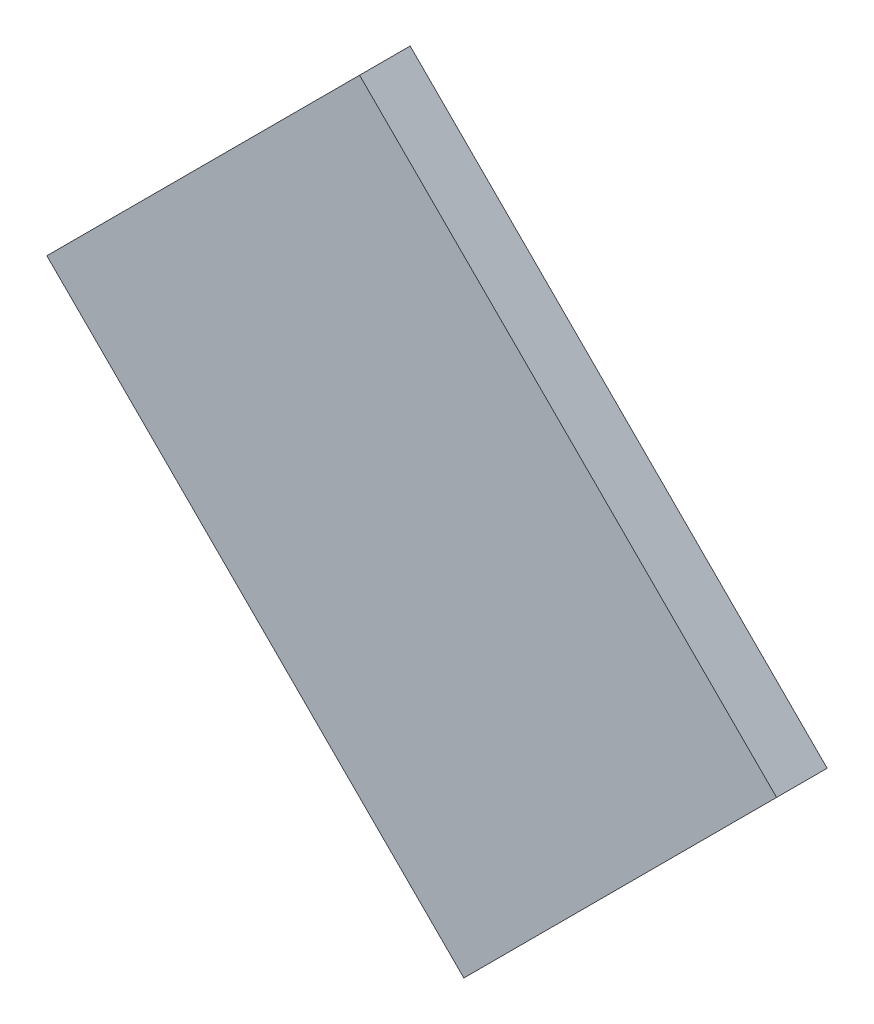
ISO-10303-21;
HEADER;
FILE_DESCRIPTION(('STEP AP214'),'2;1');
FILE_NAME('part.step','',(''),(''),'','','');
FILE_SCHEMA(('AUTOMOTIVE_DESIGN { 1 0 10303 214 1 1 1 1 }'));
ENDSEC;
DATA;
#1=APPLICATION_CONTEXT('core data for automotive mechanical design processes');
#2=APPLICATION_PROTOCOL_DEFINITION('international standard','automotive_design',2000,#1);
#3=PRODUCT_CONTEXT('',#1,'mechanical');
#4=PRODUCT('Part','Part','',(#3));
#5=PRODUCT_RELATED_PRODUCT_CATEGORY('part','',(#4));
#6=PRODUCT_DEFINITION_FORMATION('','',#4);
#7=PRODUCT_DEFINITION_CONTEXT('part definition',#1,'design');
#8=PRODUCT_DEFINITION('design','',#6,#7);
#9=PRODUCT_DEFINITION_SHAPE('','',#8);
#10=(LENGTH_UNIT() NAMED_UNIT(*) SI_UNIT(.MILLI.,.METRE.));
#11=(NAMED_UNIT(*) PLANE_ANGLE_UNIT() SI_UNIT($,.RADIAN.));
#12=(NAMED_UNIT(*) SI_UNIT($,.STERADIAN.) SOLID_ANGLE_UNIT());
#13=UNCERTAINTY_MEASURE_WITH_UNIT(LENGTH_MEASURE(1.E-05),#10,'distance_accuracy_value','');
#14=(GEOMETRIC_REPRESENTATION_CONTEXT(3) GLOBAL_UNCERTAINTY_ASSIGNED_CONTEXT((#13)) GLOBAL_UNIT_ASSIGNED_CONTEXT((#10,
#11,#12)) REPRESENTATION_CONTEXT('',''));
#15=CARTESIAN_POINT('',(0.,0.,0.));
#16=DIRECTION('',(0.,0.,1.));
#17=DIRECTION('',(1.,0.,0.));
#18=AXIS2_PLACEMENT_3D('',#15,#16,#17);
#19=CARTESIAN_POINT('',(4.5680453335,8.7844453335,0.76487));
#20=DIRECTION('',(0.,0.,-1.));
#21=DIRECTION('',(0.,1.,0.));
#22=AXIS2_PLACEMENT_3D('',#19,#20,#21);
#23=PLANE('',#22);
#24=DIRECTION('',(0.707106781186548,0.707106781186548,0.));
#25=VECTOR('',#24,1.);
#26=CARTESIAN_POINT('',(4.320558,8.819800667,0.76487));
#27=LINE('',#26,#25);
#28=CARTESIAN_POINT('',(4.320558,8.819800667,0.76487));
#29=VERTEX_POINT('',#28);
#30=CARTESIAN_POINT('',(4.53269,9.031932667,0.76487));
#31=VERTEX_POINT('',#30);
#32=EDGE_CURVE('E55',#29,#31,#27,.T.);
#33=ORIENTED_EDGE('',*,*,#32,.T.);
#34=DIRECTION('',(0.707106781186548,-0.707106781186548,0.));
#35=VECTOR('',#34,1.);
#36=CARTESIAN_POINT('',(4.53269,9.031932667,0.76487));
#37=LINE('',#36,#35);
#38=CARTESIAN_POINT('',(4.815532667,8.74909,0.76487));
#39=VERTEX_POINT('',#38);
#40=EDGE_CURVE('E57',#31,#39,#37,.T.);
#41=ORIENTED_EDGE('',*,*,#40,.T.);
#42=DIRECTION('',(-0.707106781186548,-0.707106781186548,0.));
#43=VECTOR('',#42,1.);
#44=CARTESIAN_POINT('',(4.815532667,8.74909,0.76487));
#45=LINE('',#44,#43);
#46=CARTESIAN_POINT('',(4.603400667,8.536958,0.76487));
#47=VERTEX_POINT('',#46);
#48=EDGE_CURVE('E20',#39,#47,#45,.T.);
#49=ORIENTED_EDGE('',*,*,#48,.T.);
#50=DIRECTION('',(-0.707106781186548,0.707106781186548,0.));
#51=VECTOR('',#50,1.);
#52=CARTESIAN_POINT('',(4.603400667,8.536958,0.76487));
#53=LINE('',#52,#51);
#54=EDGE_CURVE('E80',#47,#29,#53,.T.);
#55=ORIENTED_EDGE('',*,*,#54,.T.);
#56=EDGE_LOOP('',(#33,#41,#49,#55));
#57=FACE_BOUND('',#56,.T.);
#58=ADVANCED_FACE('F17',(#57),#23,.T.);
#59=CARTESIAN_POINT('',(4.815532667,8.74909,0.76487));
#60=DIRECTION('',(-0.707106781186548,0.707106781186548,0.));
#61=DIRECTION('',(-0.707106781186548,-0.707106781186548,0.));
#62=AXIS2_PLACEMENT_3D('',#59,#60,#61);
#63=PLANE('',#62);
#64=DIRECTION('',(0.,0.,1.));
#65=VECTOR('',#64,1.);
#66=CARTESIAN_POINT('',(4.603400667,8.536958,0.76487));
#67=LINE('',#66,#65);
#68=CARTESIAN_POINT('',(4.603400667,8.536958,0.79916));
#69=VERTEX_POINT('',#68);
#70=EDGE_CURVE('E68',#69,#47,#67,.F.);
#71=ORIENTED_EDGE('',*,*,#70,.T.);
#72=ORIENTED_EDGE('',*,*,#48,.F.);
#73=DIRECTION('',(0.,0.,1.));
#74=VECTOR('',#73,1.);
#75=CARTESIAN_POINT('',(4.815532667,8.74909,0.76487));
#76=LINE('',#75,#74);
#77=CARTESIAN_POINT('',(4.815532667,8.74909,0.79916));
#78=VERTEX_POINT('',#77);
#79=EDGE_CURVE('E63',#39,#78,#76,.T.);
#80=ORIENTED_EDGE('',*,*,#79,.T.);
#81=DIRECTION('',(0.707106781186548,0.707106781186548,0.));
#82=VECTOR('',#81,1.);
#83=CARTESIAN_POINT('',(4.603400667,8.536958,0.79916));
#84=LINE('',#83,#82);
#85=EDGE_CURVE('E83',#69,#78,#84,.T.);
#86=ORIENTED_EDGE('',*,*,#85,.F.);
#87=EDGE_LOOP('',(#71,#72,#80,#86));
#88=FACE_BOUND('',#87,.T.);
#89=ADVANCED_FACE('F65',(#88),#63,.F.);
#90=CARTESIAN_POINT('',(4.53269,9.031932667,0.76487));
#91=DIRECTION('',(-0.707106781186548,-0.707106781186548,0.));
#92=DIRECTION('',(0.707106781186548,-0.707106781186548,0.));
#93=AXIS2_PLACEMENT_3D('',#90,#91,#92);
#94=PLANE('',#93);
#95=ORIENTED_EDGE('',*,*,#79,.F.);
#96=ORIENTED_EDGE('',*,*,#40,.F.);
#97=DIRECTION('',(0.,0.,1.));
#98=VECTOR('',#97,1.);
#99=CARTESIAN_POINT('',(4.53269,9.031932667,0.76487));
#100=LINE('',#99,#98);
#101=CARTESIAN_POINT('',(4.53269,9.031932667,0.79916));
#102=VERTEX_POINT('',#101);
#103=EDGE_CURVE('E75',#31,#102,#100,.T.);
#104=ORIENTED_EDGE('',*,*,#103,.T.);
#105=DIRECTION('',(-0.70710678118655,0.707106781186545,0.));
#106=VECTOR('',#105,1.);
#107=CARTESIAN_POINT('',(4.815532667,8.74909,0.79916));
#108=LINE('',#107,#106);
#109=EDGE_CURVE('E72',#78,#102,#108,.T.);
#110=ORIENTED_EDGE('',*,*,#109,.F.);
#111=EDGE_LOOP('',(#95,#96,#104,#110));
#112=FACE_BOUND('',#111,.T.);
#113=ADVANCED_FACE('F70',(#112),#94,.F.);
#114=CARTESIAN_POINT('',(4.320558,8.819800667,0.76487));
#115=DIRECTION('',(0.707106781186548,-0.707106781186548,0.));
#116=DIRECTION('',(0.707106781186548,0.707106781186548,0.));
#117=AXIS2_PLACEMENT_3D('',#114,#115,#116);
#118=PLANE('',#117);
#119=ORIENTED_EDGE('',*,*,#103,.F.);
#120=ORIENTED_EDGE('',*,*,#32,.F.);
#121=DIRECTION('',(0.,0.,1.));
#122=VECTOR('',#121,1.);
#123=CARTESIAN_POINT('',(4.320558,8.819800667,0.76487));
#124=LINE('',#123,#122);
#125=CARTESIAN_POINT('',(4.320558,8.819800667,0.79916));
#126=VERTEX_POINT('',#125);
#127=EDGE_CURVE('E35',#29,#126,#124,.T.);
#128=ORIENTED_EDGE('',*,*,#127,.T.);
#129=DIRECTION('',(-0.707106781186549,-0.707106781186546,0.));
#130=VECTOR('',#129,1.);
#131=CARTESIAN_POINT('',(4.53269,9.031932667,0.79916));
#132=LINE('',#131,#130);
#133=EDGE_CURVE('E26',#102,#126,#132,.T.);
#134=ORIENTED_EDGE('',*,*,#133,.F.);
#135=EDGE_LOOP('',(#119,#120,#128,#134));
#136=FACE_BOUND('',#135,.T.);
#137=ADVANCED_FACE('F89',(#136),#118,.F.);
#138=CARTESIAN_POINT('',(4.603400667,8.536958,0.76487));
#139=DIRECTION('',(0.707106781186548,0.707106781186548,0.));
#140=DIRECTION('',(-0.707106781186548,0.707106781186548,0.));
#141=AXIS2_PLACEMENT_3D('',#138,#139,#140);
#142=PLANE('',#141);
#143=ORIENTED_EDGE('',*,*,#127,.F.);
#144=ORIENTED_EDGE('',*,*,#54,.F.);
#145=ORIENTED_EDGE('',*,*,#70,.F.);
#146=DIRECTION('',(0.707106781186546,-0.707106781186549,0.));
#147=VECTOR('',#146,1.);
#148=CARTESIAN_POINT('',(4.320558,8.819800667,0.79916));
#149=LINE('',#148,#147);
#150=EDGE_CURVE('E11',#126,#69,#149,.T.);
#151=ORIENTED_EDGE('',*,*,#150,.F.);
#152=EDGE_LOOP('',(#143,#144,#145,#151));
#153=FACE_BOUND('',#152,.T.);
#154=ADVANCED_FACE('F91',(#153),#142,.F.);
#155=CARTESIAN_POINT('',(4.5680453335,8.7844453335,0.79916));
#156=DIRECTION('',(0.,0.,1.));
#157=DIRECTION('',(0.,-1.,0.));
#158=AXIS2_PLACEMENT_3D('',#155,#156,#157);
#159=PLANE('',#158);
#160=ORIENTED_EDGE('',*,*,#133,.T.);
#161=ORIENTED_EDGE('',*,*,#150,.T.);
#162=ORIENTED_EDGE('',*,*,#85,.T.);
#163=ORIENTED_EDGE('',*,*,#109,.T.);
#164=EDGE_LOOP('',(#160,#161,#162,#163));
#165=FACE_BOUND('',#164,.T.);
#166=ADVANCED_FACE('F88',(#165),#159,.T.);
#167=CLOSED_SHELL('',(#58,#89,#113,#137,#154,#166));
#168=MANIFOLD_SOLID_BREP('B1',#167);
#169=ADVANCED_BREP_SHAPE_REPRESENTATION('',(#18,#168),#14);
#170=SHAPE_DEFINITION_REPRESENTATION(#9,#169);
ENDSEC;
END-ISO-10303-21;
